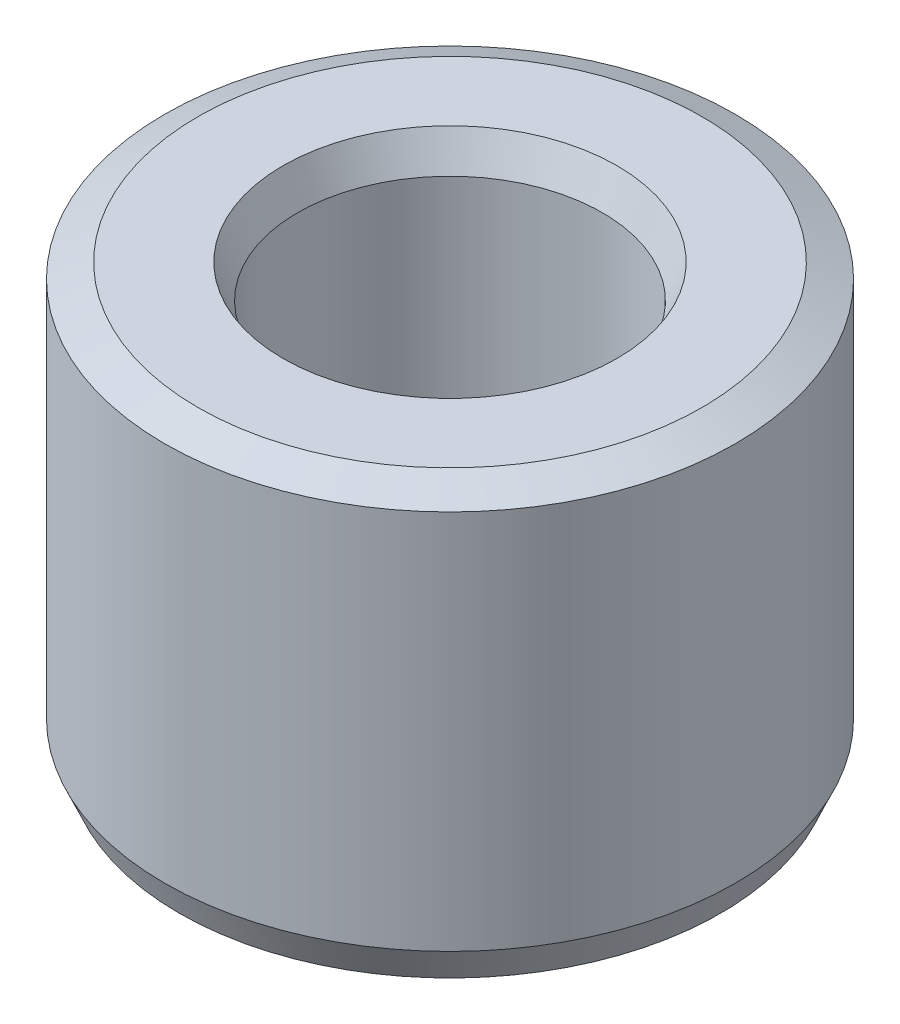
ISO-10303-21;
HEADER;
FILE_DESCRIPTION(('STEP AP214'),'2;1');
FILE_NAME('part.step','',(''),(''),'','','');
FILE_SCHEMA(('AUTOMOTIVE_DESIGN { 1 0 10303 214 1 1 1 1 }'));
ENDSEC;
DATA;
#1=APPLICATION_CONTEXT('core data for automotive mechanical design processes');
#2=APPLICATION_PROTOCOL_DEFINITION('international standard','automotive_design',2000,#1);
#3=PRODUCT_CONTEXT('',#1,'mechanical');
#4=PRODUCT('Part','Part','',(#3));
#5=PRODUCT_RELATED_PRODUCT_CATEGORY('part','',(#4));
#6=PRODUCT_DEFINITION_FORMATION('','',#4);
#7=PRODUCT_DEFINITION_CONTEXT('part definition',#1,'design');
#8=PRODUCT_DEFINITION('design','',#6,#7);
#9=PRODUCT_DEFINITION_SHAPE('','',#8);
#10=(LENGTH_UNIT() NAMED_UNIT(*) SI_UNIT(.MILLI.,.METRE.));
#11=(NAMED_UNIT(*) PLANE_ANGLE_UNIT() SI_UNIT($,.RADIAN.));
#12=(NAMED_UNIT(*) SI_UNIT($,.STERADIAN.) SOLID_ANGLE_UNIT());
#13=UNCERTAINTY_MEASURE_WITH_UNIT(LENGTH_MEASURE(1.E-05),#10,'distance_accuracy_value','');
#14=(GEOMETRIC_REPRESENTATION_CONTEXT(3) GLOBAL_UNCERTAINTY_ASSIGNED_CONTEXT((#13)) GLOBAL_UNIT_ASSIGNED_CONTEXT((#10,
#11,#12)) REPRESENTATION_CONTEXT('',''));
#15=CARTESIAN_POINT('',(0.,0.,0.));
#16=DIRECTION('',(0.,0.,1.));
#17=DIRECTION('',(1.,0.,0.));
#18=AXIS2_PLACEMENT_3D('',#15,#16,#17);
#19=CARTESIAN_POINT('',(0.,90.1202246320563,0.));
#20=DIRECTION('',(0.,-1.,0.));
#21=DIRECTION('',(0.,0.,-1.));
#22=AXIS2_PLACEMENT_3D('',#19,#20,#21);
#23=CYLINDRICAL_SURFACE('',#22,60.);
#24=CARTESIAN_POINT('',(0.,7.01531170922132,0.));
#25=DIRECTION('',(0.,1.,0.));
#26=DIRECTION('',(0.,0.,1.));
#27=AXIS2_PLACEMENT_3D('',#24,#25,#26);
#28=CIRCLE('',#27,60.);
#29=CARTESIAN_POINT('',(0.,7.01531170922132,60.));
#30=VERTEX_POINT('',#29);
#31=EDGE_CURVE('E10',#30,#30,#28,.T.);
#32=ORIENTED_EDGE('',*,*,#31,.T.);
#33=EDGE_LOOP('',(#32));
#34=FACE_BOUND('',#33,.T.);
#35=CARTESIAN_POINT('',(0.,87.0423843139405,0.));
#36=DIRECTION('',(0.,1.,0.));
#37=DIRECTION('',(0.,0.,1.));
#38=AXIS2_PLACEMENT_3D('',#35,#36,#37);
#39=CIRCLE('',#38,60.);
#40=CARTESIAN_POINT('',(0.,87.0423843139405,60.));
#41=VERTEX_POINT('',#40);
#42=EDGE_CURVE('E50',#41,#41,#39,.F.);
#43=ORIENTED_EDGE('',*,*,#42,.T.);
#44=EDGE_LOOP('',(#43));
#45=FACE_BOUND('',#44,.T.);
#46=ADVANCED_FACE('F39',(#34,#45),#23,.T.);
#47=CARTESIAN_POINT('',(0.,90.1202246320563,0.));
#48=DIRECTION('',(0.,1.,0.));
#49=DIRECTION('',(0.,0.,1.));
#50=AXIS2_PLACEMENT_3D('',#47,#48,#49);
#51=PLANE('',#50);
#52=CARTESIAN_POINT('',(0.,90.1202246320563,0.));
#53=DIRECTION('',(0.,1.,0.));
#54=DIRECTION('',(0.,0.,1.));
#55=AXIS2_PLACEMENT_3D('',#52,#53,#54);
#56=CIRCLE('',#55,35.1167402014479);
#57=CARTESIAN_POINT('',(0.,90.1202246320563,35.1167402014479));
#58=VERTEX_POINT('',#57);
#59=EDGE_CURVE('E58',#58,#58,#56,.F.);
#60=ORIENTED_EDGE('',*,*,#59,.T.);
#61=EDGE_LOOP('',(#60));
#62=FACE_BOUND('',#61,.T.);
#63=CARTESIAN_POINT('',(0.,90.1202246320563,0.));
#64=DIRECTION('',(0.,1.,0.));
#65=DIRECTION('',(0.,0.,1.));
#66=AXIS2_PLACEMENT_3D('',#63,#64,#65);
#67=CIRCLE('',#66,52.9846882907786);
#68=CARTESIAN_POINT('',(0.,90.1202246320563,52.9846882907786));
#69=VERTEX_POINT('',#68);
#70=EDGE_CURVE('E61',#69,#69,#67,.T.);
#71=ORIENTED_EDGE('',*,*,#70,.T.);
#72=EDGE_LOOP('',(#71));
#73=FACE_BOUND('',#72,.T.);
#74=ADVANCED_FACE('F88',(#62,#73),#51,.T.);
#75=CARTESIAN_POINT('',(0.,0.,0.));
#76=DIRECTION('',(0.,1.,0.));
#77=DIRECTION('',(0.,0.,1.));
#78=AXIS2_PLACEMENT_3D('',#75,#76,#77);
#79=PLANE('',#78);
#80=CARTESIAN_POINT('',(0.,0.,0.));
#81=DIRECTION('',(0.,1.,0.));
#82=DIRECTION('',(0.,0.,1.));
#83=AXIS2_PLACEMENT_3D('',#80,#81,#82);
#84=CIRCLE('',#83,39.0542115925535);
#85=CARTESIAN_POINT('',(0.,0.,39.0542115925535));
#86=VERTEX_POINT('',#85);
#87=EDGE_CURVE('E51',#86,#86,#84,.T.);
#88=ORIENTED_EDGE('',*,*,#87,.T.);
#89=EDGE_LOOP('',(#88));
#90=FACE_BOUND('',#89,.T.);
#91=CARTESIAN_POINT('',(0.,0.,0.));
#92=DIRECTION('',(0.,1.,0.));
#93=DIRECTION('',(0.,0.,1.));
#94=AXIS2_PLACEMENT_3D('',#91,#92,#93);
#95=CIRCLE('',#94,56.9221596818842);
#96=CARTESIAN_POINT('',(0.,0.,56.9221596818842));
#97=VERTEX_POINT('',#96);
#98=EDGE_CURVE('E54',#97,#97,#95,.F.);
#99=ORIENTED_EDGE('',*,*,#98,.T.);
#100=EDGE_LOOP('',(#99));
#101=FACE_BOUND('',#100,.T.);
#102=ADVANCED_FACE('F83',(#90,#101),#79,.F.);
#103=CARTESIAN_POINT('',(0.,90.1202246320563,0.));
#104=DIRECTION('',(0.,-1.,0.));
#105=DIRECTION('',(0.,0.,-1.));
#106=AXIS2_PLACEMENT_3D('',#103,#104,#105);
#107=CYLINDRICAL_SURFACE('',#106,32.0388998833321);
#108=CARTESIAN_POINT('',(0.,83.1049129228349,0.));
#109=DIRECTION('',(0.,1.,0.));
#110=DIRECTION('',(0.,0.,1.));
#111=AXIS2_PLACEMENT_3D('',#108,#109,#110);
#112=CIRCLE('',#111,32.0388998833321);
#113=CARTESIAN_POINT('',(0.,83.1049129228349,32.0388998833321));
#114=VERTEX_POINT('',#113);
#115=EDGE_CURVE('E67',#114,#114,#112,.T.);
#116=ORIENTED_EDGE('',*,*,#115,.T.);
#117=EDGE_LOOP('',(#116));
#118=FACE_BOUND('',#117,.T.);
#119=CARTESIAN_POINT('',(0.,3.07784031811582,0.));
#120=DIRECTION('',(0.,1.,0.));
#121=DIRECTION('',(0.,0.,1.));
#122=AXIS2_PLACEMENT_3D('',#119,#120,#121);
#123=CIRCLE('',#122,32.0388998833321);
#124=CARTESIAN_POINT('',(0.,3.07784031811582,32.0388998833321));
#125=VERTEX_POINT('',#124);
#126=EDGE_CURVE('E69',#125,#125,#123,.F.);
#127=ORIENTED_EDGE('',*,*,#126,.T.);
#128=EDGE_LOOP('',(#127));
#129=FACE_BOUND('',#128,.T.);
#130=ADVANCED_FACE('F71',(#118,#129),#107,.F.);
#131=CARTESIAN_POINT('',(0.,83.1049129228349,0.));
#132=DIRECTION('',(0.,1.,0.));
#133=DIRECTION('',(0.,0.,1.));
#134=AXIS2_PLACEMENT_3D('',#131,#132,#133);
#135=CONICAL_SURFACE('',#134,32.0388998833321,0.413443876165507);
#136=CARTESIAN_POINT('',(0.,90.1202246320563,35.1167402014479));
#137=CARTESIAN_POINT('',(0.,90.0471484684186,35.0846793648009));
#138=CARTESIAN_POINT('',(0.,89.9740723047809,35.0526185281538));
#139=CARTESIAN_POINT('',(0.,89.8279199775054,34.9884968548597));
#140=CARTESIAN_POINT('',(0.,89.7548438138677,34.9564360182127));
#141=CARTESIAN_POINT('',(0.,89.6086914865922,34.8923143449186));
#142=CARTESIAN_POINT('',(0.,89.5356153229545,34.8602535082716));
#143=CARTESIAN_POINT('',(0.,89.3894629956791,34.7961318349775));
#144=CARTESIAN_POINT('',(0.,89.3163868320413,34.7640709983305));
#145=CARTESIAN_POINT('',(0.,89.1702345047659,34.6999493250364));
#146=CARTESIAN_POINT('',(0.,89.0971583411282,34.6678884883893));
#147=CARTESIAN_POINT('',(0.,88.9510060138527,34.6037668150953));
#148=CARTESIAN_POINT('',(0.,88.877929850215,34.5717059784482));
#149=CARTESIAN_POINT('',(0.,88.7317775229396,34.5075843051542));
#150=CARTESIAN_POINT('',(0.,88.6587013593018,34.4755234685071));
#151=CARTESIAN_POINT('',(0.,88.5125490320264,34.411401795213));
#152=CARTESIAN_POINT('',(0.,88.4394728683887,34.379340958566));
#153=CARTESIAN_POINT('',(0.,88.2933205411132,34.3152192852719));
#154=CARTESIAN_POINT('',(0.,88.2202443774755,34.2831584486249));
#155=CARTESIAN_POINT('',(0.,88.0740920502001,34.2190367753308));
#156=CARTESIAN_POINT('',(0.,88.0010158865623,34.1869759386837));
#157=CARTESIAN_POINT('',(0.,87.8548635592869,34.1228542653897));
#158=CARTESIAN_POINT('',(0.,87.7817873956492,34.0907934287426));
#159=CARTESIAN_POINT('',(0.,87.6356350683737,34.0266717554486));
#160=CARTESIAN_POINT('',(0.,87.562558904736,33.9946109188015));
#161=CARTESIAN_POINT('',(0.,87.4164065774605,33.9304892455074));
#162=CARTESIAN_POINT('',(0.,87.3433304138228,33.8984284088604));
#163=CARTESIAN_POINT('',(0.,87.1971780865474,33.8343067355663));
#164=CARTESIAN_POINT('',(0.,87.1241019229097,33.8022458989193));
#165=CARTESIAN_POINT('',(0.,86.9779495956342,33.7381242256252));
#166=CARTESIAN_POINT('',(0.,86.9048734319965,33.7060633889782));
#167=CARTESIAN_POINT('',(0.,86.758721104721,33.6419417156841));
#168=CARTESIAN_POINT('',(0.,86.6856449410833,33.609880879037));
#169=CARTESIAN_POINT('',(0.,86.5394926138079,33.545759205743));
#170=CARTESIAN_POINT('',(0.,86.4664164501702,33.5136983690959));
#171=CARTESIAN_POINT('',(0.,86.3202641228947,33.4495766958018));
#172=CARTESIAN_POINT('',(0.,86.247187959257,33.4175158591548));
#173=CARTESIAN_POINT('',(0.,86.1010356319815,33.3533941858607));
#174=CARTESIAN_POINT('',(0.,86.0279594683438,33.3213333492137));
#175=CARTESIAN_POINT('',(0.,85.8818071410684,33.2572116759196));
#176=CARTESIAN_POINT('',(0.,85.8087309774307,33.2251508392726));
#177=CARTESIAN_POINT('',(0.,85.6625786501552,33.1610291659785));
#178=CARTESIAN_POINT('',(0.,85.5895024865175,33.1289683293314));
#179=CARTESIAN_POINT('',(0.,85.443350159242,33.0648466560374));
#180=CARTESIAN_POINT('',(0.,85.3702739956043,33.0327858193903));
#181=CARTESIAN_POINT('',(0.,85.2241216683289,32.9686641460962));
#182=CARTESIAN_POINT('',(0.,85.1510455046911,32.9366033094492));
#183=CARTESIAN_POINT('',(0.,85.0048931774157,32.8724816361551));
#184=CARTESIAN_POINT('',(0.,84.931817013778,32.8404207995081));
#185=CARTESIAN_POINT('',(0.,84.7856646865025,32.776299126214));
#186=CARTESIAN_POINT('',(0.,84.7125885228648,32.744238289567));
#187=CARTESIAN_POINT('',(0.,84.5664361955894,32.6801166162729));
#188=CARTESIAN_POINT('',(0.,84.4933600319516,32.6480557796258));
#189=CARTESIAN_POINT('',(0.,84.3472077046762,32.5839341063318));
#190=CARTESIAN_POINT('',(0.,84.2741315410385,32.5518732696847));
#191=CARTESIAN_POINT('',(0.,84.127979213763,32.4877515963906));
#192=CARTESIAN_POINT('',(0.,84.0549030501253,32.4556907597436));
#193=CARTESIAN_POINT('',(0.,83.9087507228499,32.3915690864495));
#194=CARTESIAN_POINT('',(0.,83.8356745592121,32.3595082498025));
#195=CARTESIAN_POINT('',(0.,83.6895222319367,32.2953865765084));
#196=CARTESIAN_POINT('',(0.,83.616446068299,32.2633257398614));
#197=CARTESIAN_POINT('',(0.,83.4702937410235,32.1992040665673));
#198=CARTESIAN_POINT('',(0.,83.3972175773858,32.1671432299202));
#199=CARTESIAN_POINT('',(0.,83.2510652501103,32.1030215566262));
#200=CARTESIAN_POINT('',(0.,83.1779890864726,32.0709607199791));
#201=CARTESIAN_POINT('',(0.,83.1049129228349,32.0388998833321));
#202=B_SPLINE_CURVE_WITH_KNOTS('',3,(#136,#137,#138,#139,#140,#141,#142,#143,#144,#145,#146,
#147,#148,#149,#150,#151,#152,#153,#154,#155,#156,#157,#158,#159,#160,#161,#162,#163,#164,#165,
#166,#167,#168,#169,#170,#171,#172,#173,#174,#175,#176,#177,#178,#179,#180,#181,#182,#183,#184,
#185,#186,#187,#188,#189,#190,#191,#192,#193,#194,#195,#196,#197,#198,#199,#200,#201),
.UNSPECIFIED.,.F.,.F.,(4,2,2,2,2,2,2,2,2,2,2,2,2,2,2,2,2,2,2,2,2,2,2,2,2,2,2,2,2,2,2,2,4),(0.,
0.239399679295194,0.478799358590385,0.718199037885576,0.957598717180757,1.19699839647595,
1.43639807577114,1.67579775506632,1.91519743436151,2.1545971136567,2.39399679295188,
2.63339647224708,2.87279615154227,3.11219583083745,3.35159551013264,3.59099518942783,
3.83039486872301,4.0697945480182,4.3091942273134,4.54859390660859,4.78799358590377,
5.02739326519896,5.26679294449415,5.50619262378933,5.74559230308452,5.98499198237971,
6.22439166167489,6.46379134097009,6.70319102026528,6.94259069956046,7.18199037885565,
7.42139005815084,7.66078973744602),.UNSPECIFIED.);
#203=EDGE_CURVE('BSEAM77',#58,#114,#202,.T.);
#204=ORIENTED_EDGE('',*,*,#59,.F.);
#205=ORIENTED_EDGE('',*,*,#115,.F.);
#206=ORIENTED_EDGE('',*,*,#203,.T.);
#207=ORIENTED_EDGE('',*,*,#203,.F.);
#208=EDGE_LOOP('',(#204,#206,#205,#207));
#209=FACE_BOUND('',#208,.T.);
#210=ADVANCED_FACE('F77',(#209),#135,.F.);
#211=CARTESIAN_POINT('',(0.,0.,0.));
#212=DIRECTION('',(0.,-1.,0.));
#213=DIRECTION('',(0.,0.,-1.));
#214=AXIS2_PLACEMENT_3D('',#211,#212,#213);
#215=CONICAL_SURFACE('',#214,39.0542115925535,1.15735245062939);
#216=ORIENTED_EDGE('',*,*,#126,.F.);
#217=EDGE_LOOP('',(#216));
#218=FACE_BOUND('',#217,.T.);
#219=ORIENTED_EDGE('',*,*,#87,.F.);
#220=EDGE_LOOP('',(#219));
#221=FACE_BOUND('',#220,.T.);
#222=ADVANCED_FACE('F73',(#218,#221),#215,.F.);
#223=CARTESIAN_POINT('',(0.,7.01531170922132,0.));
#224=DIRECTION('',(0.,1.,0.));
#225=DIRECTION('',(0.,0.,1.));
#226=AXIS2_PLACEMENT_3D('',#223,#224,#225);
#227=CONICAL_SURFACE('',#226,60.,0.413443876165505);
#228=ORIENTED_EDGE('',*,*,#98,.F.);
#229=EDGE_LOOP('',(#228));
#230=FACE_BOUND('',#229,.T.);
#231=ORIENTED_EDGE('',*,*,#31,.F.);
#232=EDGE_LOOP('',(#231));
#233=FACE_BOUND('',#232,.T.);
#234=ADVANCED_FACE('F76',(#230,#233),#227,.T.);
#235=CARTESIAN_POINT('',(0.,90.1202246320563,0.));
#236=DIRECTION('',(0.,-1.,0.));
#237=DIRECTION('',(0.,0.,-1.));
#238=AXIS2_PLACEMENT_3D('',#235,#236,#237);
#239=CONICAL_SURFACE('',#238,52.9846882907786,1.15735245062939);
#240=ORIENTED_EDGE('',*,*,#42,.F.);
#241=EDGE_LOOP('',(#240));
#242=FACE_BOUND('',#241,.T.);
#243=ORIENTED_EDGE('',*,*,#70,.F.);
#244=EDGE_LOOP('',(#243));
#245=FACE_BOUND('',#244,.T.);
#246=ADVANCED_FACE('F45',(#242,#245),#239,.T.);
#247=CLOSED_SHELL('',(#46,#74,#102,#130,#210,#222,#234,#246));
#248=MANIFOLD_SOLID_BREP('B2',#247);
#249=ADVANCED_BREP_SHAPE_REPRESENTATION('',(#18,#248),#14);
#250=SHAPE_DEFINITION_REPRESENTATION(#9,#249);
ENDSEC;
END-ISO-10303-21;
